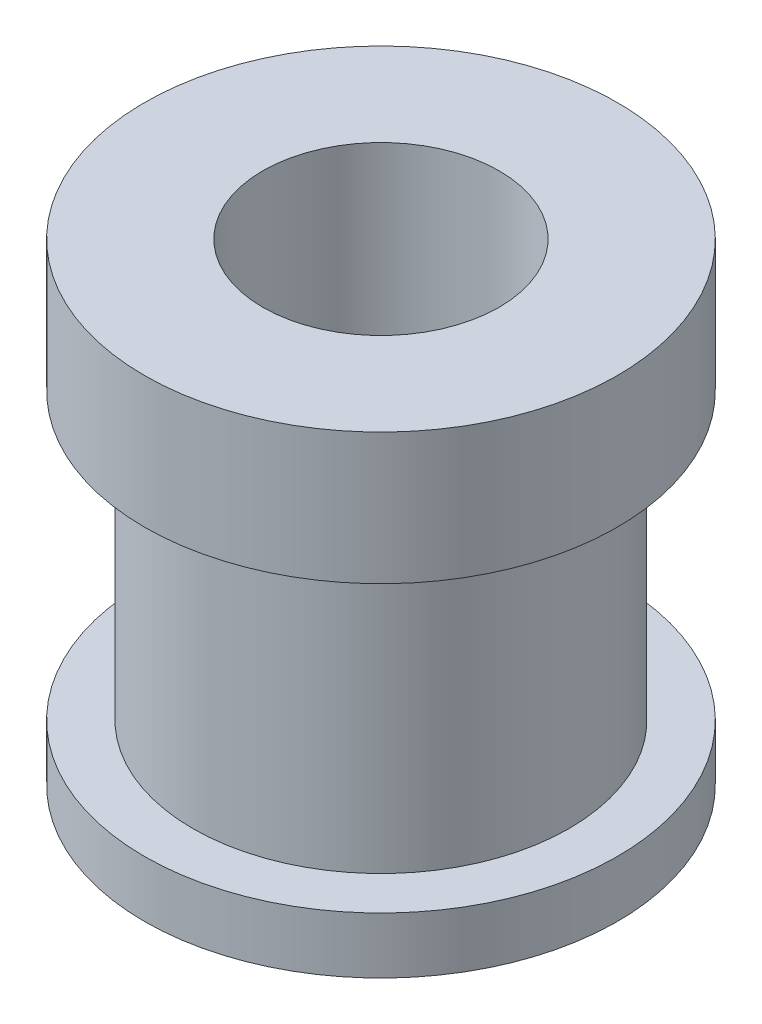
ISO-10303-21;
HEADER;
FILE_DESCRIPTION(('STEP AP214'),'2;1');
FILE_NAME('part.step','',(''),(''),'','','');
FILE_SCHEMA(('AUTOMOTIVE_DESIGN { 1 0 10303 214 1 1 1 1 }'));
ENDSEC;
DATA;
#1=APPLICATION_CONTEXT('core data for automotive mechanical design processes');
#2=APPLICATION_PROTOCOL_DEFINITION('international standard','automotive_design',2000,#1);
#3=PRODUCT_CONTEXT('',#1,'mechanical');
#4=PRODUCT('Part','Part','',(#3));
#5=PRODUCT_RELATED_PRODUCT_CATEGORY('part','',(#4));
#6=PRODUCT_DEFINITION_FORMATION('','',#4);
#7=PRODUCT_DEFINITION_CONTEXT('part definition',#1,'design');
#8=PRODUCT_DEFINITION('design','',#6,#7);
#9=PRODUCT_DEFINITION_SHAPE('','',#8);
#10=(LENGTH_UNIT() NAMED_UNIT(*) SI_UNIT(.MILLI.,.METRE.));
#11=(NAMED_UNIT(*) PLANE_ANGLE_UNIT() SI_UNIT($,.RADIAN.));
#12=(NAMED_UNIT(*) SI_UNIT($,.STERADIAN.) SOLID_ANGLE_UNIT());
#13=UNCERTAINTY_MEASURE_WITH_UNIT(LENGTH_MEASURE(1.E-05),#10,'distance_accuracy_value','');
#14=(GEOMETRIC_REPRESENTATION_CONTEXT(3) GLOBAL_UNCERTAINTY_ASSIGNED_CONTEXT((#13)) GLOBAL_UNIT_ASSIGNED_CONTEXT((#10,
#11,#12)) REPRESENTATION_CONTEXT('',''));
#15=CARTESIAN_POINT('',(0.,0.,0.));
#16=DIRECTION('',(0.,0.,1.));
#17=DIRECTION('',(1.,0.,0.));
#18=AXIS2_PLACEMENT_3D('',#15,#16,#17);
#19=CARTESIAN_POINT('',(0.,-8.,0.));
#20=DIRECTION('',(0.,1.,0.));
#21=DIRECTION('',(0.,0.,1.));
#22=AXIS2_PLACEMENT_3D('',#19,#20,#21);
#23=CYLINDRICAL_SURFACE('',#22,8.);
#24=CARTESIAN_POINT('',(0.,3.556,0.));
#25=DIRECTION('',(0.,1.,0.));
#26=DIRECTION('',(0.,0.,1.));
#27=AXIS2_PLACEMENT_3D('',#24,#25,#26);
#28=CIRCLE('',#27,8.);
#29=CARTESIAN_POINT('',(0.,3.556,8.));
#30=VERTEX_POINT('',#29);
#31=EDGE_CURVE('E40',#30,#30,#28,.T.);
#32=ORIENTED_EDGE('',*,*,#31,.T.);
#33=EDGE_LOOP('',(#32));
#34=FACE_BOUND('',#33,.T.);
#35=CARTESIAN_POINT('',(0.,8.,0.));
#36=DIRECTION('',(0.,1.,0.));
#37=DIRECTION('',(0.,0.,1.));
#38=AXIS2_PLACEMENT_3D('',#35,#36,#37);
#39=CIRCLE('',#38,8.);
#40=CARTESIAN_POINT('',(0.,8.,8.));
#41=VERTEX_POINT('',#40);
#42=EDGE_CURVE('E36',#41,#41,#39,.T.);
#43=ORIENTED_EDGE('',*,*,#42,.F.);
#44=EDGE_LOOP('',(#43));
#45=FACE_BOUND('',#44,.T.);
#46=ADVANCED_FACE('F30',(#34,#45),#23,.T.);
#47=CARTESIAN_POINT('',(0.,8.,0.));
#48=DIRECTION('',(0.,1.,0.));
#49=DIRECTION('',(0.,0.,1.));
#50=AXIS2_PLACEMENT_3D('',#47,#48,#49);
#51=PLANE('',#50);
#52=CARTESIAN_POINT('',(0.,8.,0.));
#53=DIRECTION('',(0.,1.,0.));
#54=DIRECTION('',(0.,0.,1.));
#55=AXIS2_PLACEMENT_3D('',#52,#53,#54);
#56=CIRCLE('',#55,4.);
#57=CARTESIAN_POINT('',(0.,8.,4.));
#58=VERTEX_POINT('',#57);
#59=EDGE_CURVE('E56',#58,#58,#56,.T.);
#60=ORIENTED_EDGE('',*,*,#59,.F.);
#61=EDGE_LOOP('',(#60));
#62=FACE_BOUND('',#61,.T.);
#63=ORIENTED_EDGE('',*,*,#42,.T.);
#64=EDGE_LOOP('',(#63));
#65=FACE_BOUND('',#64,.T.);
#66=ADVANCED_FACE('F72',(#62,#65),#51,.T.);
#67=CARTESIAN_POINT('',(0.,3.556,0.));
#68=DIRECTION('',(0.,1.,0.));
#69=DIRECTION('',(0.,0.,1.));
#70=AXIS2_PLACEMENT_3D('',#67,#68,#69);
#71=PLANE('',#70);
#72=ORIENTED_EDGE('',*,*,#31,.F.);
#73=EDGE_LOOP('',(#72));
#74=FACE_BOUND('',#73,.T.);
#75=CARTESIAN_POINT('',(0.,3.556,0.));
#76=DIRECTION('',(0.,1.,0.));
#77=DIRECTION('',(0.,0.,1.));
#78=AXIS2_PLACEMENT_3D('',#75,#76,#77);
#79=CIRCLE('',#78,6.36499997);
#80=CARTESIAN_POINT('',(0.,3.556,6.36499997));
#81=VERTEX_POINT('',#80);
#82=EDGE_CURVE('E44',#81,#81,#79,.T.);
#83=ORIENTED_EDGE('',*,*,#82,.T.);
#84=EDGE_LOOP('',(#83));
#85=FACE_BOUND('',#84,.T.);
#86=ADVANCED_FACE('F74',(#74,#85),#71,.F.);
#87=CARTESIAN_POINT('',(0.,3.556,0.));
#88=DIRECTION('',(0.,-1.,0.));
#89=DIRECTION('',(0.,0.,-1.));
#90=AXIS2_PLACEMENT_3D('',#87,#88,#89);
#91=CYLINDRICAL_SURFACE('',#90,6.36499997);
#92=ORIENTED_EDGE('',*,*,#82,.F.);
#93=EDGE_LOOP('',(#92));
#94=FACE_BOUND('',#93,.T.);
#95=CARTESIAN_POINT('',(0.,-6.094,0.));
#96=DIRECTION('',(0.,1.,0.));
#97=DIRECTION('',(0.,0.,1.));
#98=AXIS2_PLACEMENT_3D('',#95,#96,#97);
#99=CIRCLE('',#98,6.36499997);
#100=CARTESIAN_POINT('',(0.,-6.094,6.36499997));
#101=VERTEX_POINT('',#100);
#102=EDGE_CURVE('E52',#101,#101,#99,.T.);
#103=ORIENTED_EDGE('',*,*,#102,.T.);
#104=EDGE_LOOP('',(#103));
#105=FACE_BOUND('',#104,.T.);
#106=ADVANCED_FACE('F80',(#94,#105),#91,.T.);
#107=CARTESIAN_POINT('',(0.,-6.094,0.));
#108=DIRECTION('',(0.,1.,0.));
#109=DIRECTION('',(0.,0.,1.));
#110=AXIS2_PLACEMENT_3D('',#107,#108,#109);
#111=PLANE('',#110);
#112=ORIENTED_EDGE('',*,*,#102,.F.);
#113=EDGE_LOOP('',(#112));
#114=FACE_BOUND('',#113,.T.);
#115=CARTESIAN_POINT('',(0.,-6.094,0.));
#116=DIRECTION('',(0.,1.,0.));
#117=DIRECTION('',(0.,0.,1.));
#118=AXIS2_PLACEMENT_3D('',#115,#116,#117);
#119=CIRCLE('',#118,8.);
#120=CARTESIAN_POINT('',(0.,-6.094,8.));
#121=VERTEX_POINT('',#120);
#122=EDGE_CURVE('E49',#121,#121,#119,.T.);
#123=ORIENTED_EDGE('',*,*,#122,.T.);
#124=EDGE_LOOP('',(#123));
#125=FACE_BOUND('',#124,.T.);
#126=ADVANCED_FACE('F86',(#114,#125),#111,.T.);
#127=CARTESIAN_POINT('',(0.,-8.,0.));
#128=DIRECTION('',(0.,1.,0.));
#129=DIRECTION('',(0.,0.,1.));
#130=AXIS2_PLACEMENT_3D('',#127,#128,#129);
#131=PLANE('',#130);
#132=CARTESIAN_POINT('',(0.,-8.,0.));
#133=DIRECTION('',(0.,1.,0.));
#134=DIRECTION('',(0.,0.,1.));
#135=AXIS2_PLACEMENT_3D('',#132,#133,#134);
#136=CIRCLE('',#135,4.);
#137=CARTESIAN_POINT('',(0.,-8.,4.));
#138=VERTEX_POINT('',#137);
#139=EDGE_CURVE('E55',#138,#138,#136,.T.);
#140=ORIENTED_EDGE('',*,*,#139,.T.);
#141=EDGE_LOOP('',(#140));
#142=FACE_BOUND('',#141,.T.);
#143=CARTESIAN_POINT('',(0.,-8.,0.));
#144=DIRECTION('',(0.,1.,0.));
#145=DIRECTION('',(0.,0.,1.));
#146=AXIS2_PLACEMENT_3D('',#143,#144,#145);
#147=CIRCLE('',#146,8.);
#148=CARTESIAN_POINT('',(0.,-8.,8.));
#149=VERTEX_POINT('',#148);
#150=EDGE_CURVE('E10',#149,#149,#147,.T.);
#151=ORIENTED_EDGE('',*,*,#150,.F.);
#152=EDGE_LOOP('',(#151));
#153=FACE_BOUND('',#152,.T.);
#154=ADVANCED_FACE('F62',(#142,#153),#131,.F.);
#155=ORIENTED_EDGE('',*,*,#150,.T.);
#156=EDGE_LOOP('',(#155));
#157=FACE_BOUND('',#156,.T.);
#158=ORIENTED_EDGE('',*,*,#122,.F.);
#159=EDGE_LOOP('',(#158));
#160=FACE_BOUND('',#159,.T.);
#161=ADVANCED_FACE('F68',(#157,#160),#23,.T.);
#162=CARTESIAN_POINT('',(0.,-8.,0.));
#163=DIRECTION('',(0.,1.,0.));
#164=DIRECTION('',(0.,0.,1.));
#165=AXIS2_PLACEMENT_3D('',#162,#163,#164);
#166=CYLINDRICAL_SURFACE('',#165,4.);
#167=ORIENTED_EDGE('',*,*,#139,.F.);
#168=EDGE_LOOP('',(#167));
#169=FACE_BOUND('',#168,.T.);
#170=ORIENTED_EDGE('',*,*,#59,.T.);
#171=EDGE_LOOP('',(#170));
#172=FACE_BOUND('',#171,.T.);
#173=ADVANCED_FACE('F65',(#169,#172),#166,.F.);
#174=CLOSED_SHELL('',(#46,#66,#86,#106,#126,#154,#161,#173));
#175=MANIFOLD_SOLID_BREP('B2',#174);
#176=ADVANCED_BREP_SHAPE_REPRESENTATION('',(#18,#175),#14);
#177=SHAPE_DEFINITION_REPRESENTATION(#9,#176);
ENDSEC;
END-ISO-10303-21;
